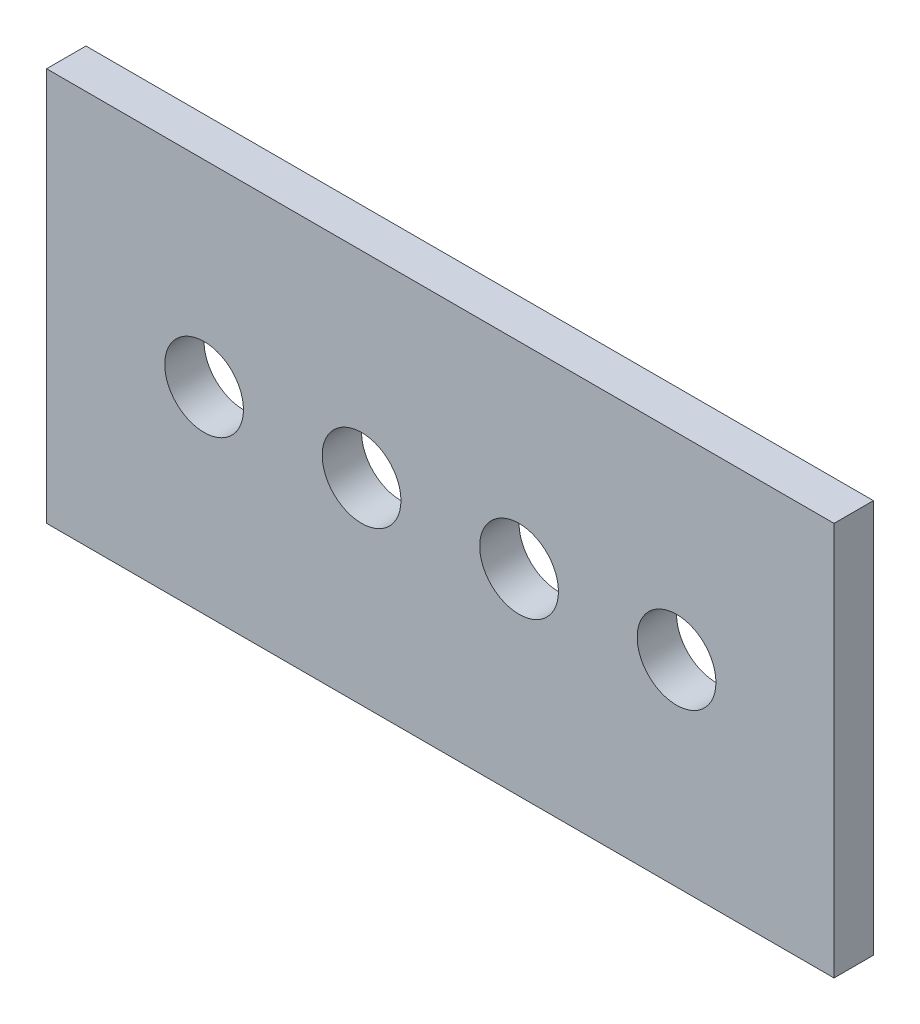
ISO-10303-21;
HEADER;
FILE_DESCRIPTION(('STEP AP214'),'2;1');
FILE_NAME('part.step','',(''),(''),'','','');
FILE_SCHEMA(('AUTOMOTIVE_DESIGN { 1 0 10303 214 1 1 1 1 }'));
ENDSEC;
DATA;
#1=APPLICATION_CONTEXT('core data for automotive mechanical design processes');
#2=APPLICATION_PROTOCOL_DEFINITION('international standard','automotive_design',2000,#1);
#3=PRODUCT_CONTEXT('',#1,'mechanical');
#4=PRODUCT('Part','Part','',(#3));
#5=PRODUCT_RELATED_PRODUCT_CATEGORY('part','',(#4));
#6=PRODUCT_DEFINITION_FORMATION('','',#4);
#7=PRODUCT_DEFINITION_CONTEXT('part definition',#1,'design');
#8=PRODUCT_DEFINITION('design','',#6,#7);
#9=PRODUCT_DEFINITION_SHAPE('','',#8);
#10=(LENGTH_UNIT() NAMED_UNIT(*) SI_UNIT(.MILLI.,.METRE.));
#11=(NAMED_UNIT(*) PLANE_ANGLE_UNIT() SI_UNIT($,.RADIAN.));
#12=(NAMED_UNIT(*) SI_UNIT($,.STERADIAN.) SOLID_ANGLE_UNIT());
#13=UNCERTAINTY_MEASURE_WITH_UNIT(LENGTH_MEASURE(1.E-05),#10,'distance_accuracy_value','');
#14=(GEOMETRIC_REPRESENTATION_CONTEXT(3) GLOBAL_UNCERTAINTY_ASSIGNED_CONTEXT((#13)) GLOBAL_UNIT_ASSIGNED_CONTEXT((#10,
#11,#12)) REPRESENTATION_CONTEXT('',''));
#15=CARTESIAN_POINT('',(0.,0.,0.));
#16=DIRECTION('',(0.,0.,1.));
#17=DIRECTION('',(1.,0.,0.));
#18=AXIS2_PLACEMENT_3D('',#15,#16,#17);
#19=CARTESIAN_POINT('',(0.,0.,5.));
#20=DIRECTION('',(0.,0.,-1.));
#21=DIRECTION('',(-1.,0.,0.));
#22=AXIS2_PLACEMENT_3D('',#19,#20,#21);
#23=PLANE('',#22);
#24=DIRECTION('',(0.,-1.,0.));
#25=VECTOR('',#24,1.);
#26=CARTESIAN_POINT('',(0.,0.,5.));
#27=LINE('',#26,#25);
#28=CARTESIAN_POINT('',(0.,50.,5.));
#29=VERTEX_POINT('',#28);
#30=CARTESIAN_POINT('',(0.,0.,5.));
#31=VERTEX_POINT('',#30);
#32=EDGE_CURVE('E89',#29,#31,#27,.T.);
#33=ORIENTED_EDGE('',*,*,#32,.T.);
#34=DIRECTION('',(1.,0.,0.));
#35=VECTOR('',#34,1.);
#36=CARTESIAN_POINT('',(0.,0.,5.));
#37=LINE('',#36,#35);
#38=CARTESIAN_POINT('',(100.,0.,5.));
#39=VERTEX_POINT('',#38);
#40=EDGE_CURVE('E84',#31,#39,#37,.T.);
#41=ORIENTED_EDGE('',*,*,#40,.T.);
#42=DIRECTION('',(0.,1.,0.));
#43=VECTOR('',#42,1.);
#44=CARTESIAN_POINT('',(100.,0.,5.));
#45=LINE('',#44,#43);
#46=CARTESIAN_POINT('',(100.,50.,5.));
#47=VERTEX_POINT('',#46);
#48=EDGE_CURVE('E87',#39,#47,#45,.T.);
#49=ORIENTED_EDGE('',*,*,#48,.T.);
#50=DIRECTION('',(-1.,0.,0.));
#51=VECTOR('',#50,1.);
#52=CARTESIAN_POINT('',(0.,50.,5.));
#53=LINE('',#52,#51);
#54=EDGE_CURVE('E54',#47,#29,#53,.T.);
#55=ORIENTED_EDGE('',*,*,#54,.T.);
#56=EDGE_LOOP('',(#33,#41,#49,#55));
#57=FACE_BOUND('',#56,.T.);
#58=CARTESIAN_POINT('',(20.,25.,5.));
#59=DIRECTION('',(0.,0.,1.));
#60=DIRECTION('',(1.,0.,0.));
#61=AXIS2_PLACEMENT_3D('',#58,#59,#60);
#62=CIRCLE('',#61,5.);
#63=CARTESIAN_POINT('',(25.,25.,5.));
#64=VERTEX_POINT('',#63);
#65=EDGE_CURVE('E104',#64,#64,#62,.T.);
#66=ORIENTED_EDGE('',*,*,#65,.F.);
#67=EDGE_LOOP('',(#66));
#68=FACE_BOUND('',#67,.T.);
#69=CARTESIAN_POINT('',(40.,25.,5.));
#70=DIRECTION('',(0.,0.,1.));
#71=DIRECTION('',(1.,0.,0.));
#72=AXIS2_PLACEMENT_3D('',#69,#70,#71);
#73=CIRCLE('',#72,5.);
#74=CARTESIAN_POINT('',(45.,25.,5.));
#75=VERTEX_POINT('',#74);
#76=EDGE_CURVE('E119',#75,#75,#73,.T.);
#77=ORIENTED_EDGE('',*,*,#76,.F.);
#78=EDGE_LOOP('',(#77));
#79=FACE_BOUND('',#78,.T.);
#80=CARTESIAN_POINT('',(60.,25.,5.));
#81=DIRECTION('',(0.,0.,1.));
#82=DIRECTION('',(1.,0.,0.));
#83=AXIS2_PLACEMENT_3D('',#80,#81,#82);
#84=CIRCLE('',#83,5.);
#85=CARTESIAN_POINT('',(65.,25.,5.));
#86=VERTEX_POINT('',#85);
#87=EDGE_CURVE('E125',#86,#86,#84,.T.);
#88=ORIENTED_EDGE('',*,*,#87,.F.);
#89=EDGE_LOOP('',(#88));
#90=FACE_BOUND('',#89,.T.);
#91=CARTESIAN_POINT('',(80.,25.,5.));
#92=DIRECTION('',(0.,0.,1.));
#93=DIRECTION('',(1.,0.,0.));
#94=AXIS2_PLACEMENT_3D('',#91,#92,#93);
#95=CIRCLE('',#94,5.);
#96=CARTESIAN_POINT('',(85.,25.,5.));
#97=VERTEX_POINT('',#96);
#98=EDGE_CURVE('E131',#97,#97,#95,.T.);
#99=ORIENTED_EDGE('',*,*,#98,.F.);
#100=EDGE_LOOP('',(#99));
#101=FACE_BOUND('',#100,.T.);
#102=ADVANCED_FACE('F37',(#57,#68,#79,#90,#101),#23,.F.);
#103=CARTESIAN_POINT('',(0.,0.,0.));
#104=DIRECTION('',(0.,0.,-1.));
#105=DIRECTION('',(-1.,0.,0.));
#106=AXIS2_PLACEMENT_3D('',#103,#104,#105);
#107=PLANE('',#106);
#108=CARTESIAN_POINT('',(60.,25.,0.));
#109=DIRECTION('',(0.,0.,1.));
#110=DIRECTION('',(1.,0.,0.));
#111=AXIS2_PLACEMENT_3D('',#108,#109,#110);
#112=CIRCLE('',#111,5.);
#113=CARTESIAN_POINT('',(65.,25.,0.));
#114=VERTEX_POINT('',#113);
#115=EDGE_CURVE('E128',#114,#114,#112,.T.);
#116=ORIENTED_EDGE('',*,*,#115,.T.);
#117=EDGE_LOOP('',(#116));
#118=FACE_BOUND('',#117,.T.);
#119=CARTESIAN_POINT('',(20.,25.,0.));
#120=DIRECTION('',(0.,0.,1.));
#121=DIRECTION('',(1.,0.,0.));
#122=AXIS2_PLACEMENT_3D('',#119,#120,#121);
#123=CIRCLE('',#122,5.);
#124=CARTESIAN_POINT('',(25.,25.,0.));
#125=VERTEX_POINT('',#124);
#126=EDGE_CURVE('E116',#125,#125,#123,.T.);
#127=ORIENTED_EDGE('',*,*,#126,.T.);
#128=EDGE_LOOP('',(#127));
#129=FACE_BOUND('',#128,.T.);
#130=DIRECTION('',(0.,-1.,0.));
#131=VECTOR('',#130,1.);
#132=CARTESIAN_POINT('',(0.,0.,0.));
#133=LINE('',#132,#131);
#134=CARTESIAN_POINT('',(0.,50.,0.));
#135=VERTEX_POINT('',#134);
#136=CARTESIAN_POINT('',(0.,0.,0.));
#137=VERTEX_POINT('',#136);
#138=EDGE_CURVE('E101',#135,#137,#133,.T.);
#139=ORIENTED_EDGE('',*,*,#138,.F.);
#140=DIRECTION('',(-1.,0.,0.));
#141=VECTOR('',#140,1.);
#142=CARTESIAN_POINT('',(0.,50.,0.));
#143=LINE('',#142,#141);
#144=CARTESIAN_POINT('',(100.,50.,0.));
#145=VERTEX_POINT('',#144);
#146=EDGE_CURVE('E77',#145,#135,#143,.T.);
#147=ORIENTED_EDGE('',*,*,#146,.F.);
#148=DIRECTION('',(0.,1.,0.));
#149=VECTOR('',#148,1.);
#150=CARTESIAN_POINT('',(100.,0.,0.));
#151=LINE('',#150,#149);
#152=CARTESIAN_POINT('',(100.,0.,0.));
#153=VERTEX_POINT('',#152);
#154=EDGE_CURVE('E71',#153,#145,#151,.T.);
#155=ORIENTED_EDGE('',*,*,#154,.F.);
#156=DIRECTION('',(1.,0.,0.));
#157=VECTOR('',#156,1.);
#158=CARTESIAN_POINT('',(0.,0.,0.));
#159=LINE('',#158,#157);
#160=EDGE_CURVE('E93',#137,#153,#159,.T.);
#161=ORIENTED_EDGE('',*,*,#160,.F.);
#162=EDGE_LOOP('',(#139,#147,#155,#161));
#163=FACE_BOUND('',#162,.T.);
#164=CARTESIAN_POINT('',(40.,25.,0.));
#165=DIRECTION('',(0.,0.,1.));
#166=DIRECTION('',(1.,0.,0.));
#167=AXIS2_PLACEMENT_3D('',#164,#165,#166);
#168=CIRCLE('',#167,5.);
#169=CARTESIAN_POINT('',(45.,25.,0.));
#170=VERTEX_POINT('',#169);
#171=EDGE_CURVE('E122',#170,#170,#168,.T.);
#172=ORIENTED_EDGE('',*,*,#171,.T.);
#173=EDGE_LOOP('',(#172));
#174=FACE_BOUND('',#173,.T.);
#175=CARTESIAN_POINT('',(80.,25.,0.));
#176=DIRECTION('',(0.,0.,1.));
#177=DIRECTION('',(1.,0.,0.));
#178=AXIS2_PLACEMENT_3D('',#175,#176,#177);
#179=CIRCLE('',#178,5.);
#180=CARTESIAN_POINT('',(85.,25.,0.));
#181=VERTEX_POINT('',#180);
#182=EDGE_CURVE('E134',#181,#181,#179,.T.);
#183=ORIENTED_EDGE('',*,*,#182,.T.);
#184=EDGE_LOOP('',(#183));
#185=FACE_BOUND('',#184,.T.);
#186=ADVANCED_FACE('F112',(#118,#129,#163,#174,#185),#107,.T.);
#187=CARTESIAN_POINT('',(0.,0.,5.));
#188=DIRECTION('',(1.,0.,0.));
#189=DIRECTION('',(0.,0.,-1.));
#190=AXIS2_PLACEMENT_3D('',#187,#188,#189);
#191=PLANE('',#190);
#192=ORIENTED_EDGE('',*,*,#138,.T.);
#193=DIRECTION('',(0.,0.,-1.));
#194=VECTOR('',#193,1.);
#195=CARTESIAN_POINT('',(0.,0.,5.));
#196=LINE('',#195,#194);
#197=EDGE_CURVE('E11',#31,#137,#196,.T.);
#198=ORIENTED_EDGE('',*,*,#197,.F.);
#199=ORIENTED_EDGE('',*,*,#32,.F.);
#200=DIRECTION('',(0.,0.,-1.));
#201=VECTOR('',#200,1.);
#202=CARTESIAN_POINT('',(0.,50.,5.));
#203=LINE('',#202,#201);
#204=EDGE_CURVE('E97',#29,#135,#203,.T.);
#205=ORIENTED_EDGE('',*,*,#204,.T.);
#206=EDGE_LOOP('',(#192,#198,#199,#205));
#207=FACE_BOUND('',#206,.T.);
#208=ADVANCED_FACE('F39',(#207),#191,.F.);
#209=CARTESIAN_POINT('',(0.,0.,5.));
#210=DIRECTION('',(0.,1.,0.));
#211=DIRECTION('',(0.,0.,1.));
#212=AXIS2_PLACEMENT_3D('',#209,#210,#211);
#213=PLANE('',#212);
#214=ORIENTED_EDGE('',*,*,#160,.T.);
#215=DIRECTION('',(0.,0.,-1.));
#216=VECTOR('',#215,1.);
#217=CARTESIAN_POINT('',(100.,0.,5.));
#218=LINE('',#217,#216);
#219=EDGE_CURVE('E46',#39,#153,#218,.T.);
#220=ORIENTED_EDGE('',*,*,#219,.F.);
#221=ORIENTED_EDGE('',*,*,#40,.F.);
#222=ORIENTED_EDGE('',*,*,#197,.T.);
#223=EDGE_LOOP('',(#214,#220,#221,#222));
#224=FACE_BOUND('',#223,.T.);
#225=ADVANCED_FACE('F92',(#224),#213,.F.);
#226=CARTESIAN_POINT('',(100.,0.,5.));
#227=DIRECTION('',(-1.,0.,0.));
#228=DIRECTION('',(0.,0.,1.));
#229=AXIS2_PLACEMENT_3D('',#226,#227,#228);
#230=PLANE('',#229);
#231=ORIENTED_EDGE('',*,*,#154,.T.);
#232=DIRECTION('',(0.,0.,-1.));
#233=VECTOR('',#232,1.);
#234=CARTESIAN_POINT('',(100.,50.,5.));
#235=LINE('',#234,#233);
#236=EDGE_CURVE('E94',#47,#145,#235,.T.);
#237=ORIENTED_EDGE('',*,*,#236,.F.);
#238=ORIENTED_EDGE('',*,*,#48,.F.);
#239=ORIENTED_EDGE('',*,*,#219,.T.);
#240=EDGE_LOOP('',(#231,#237,#238,#239));
#241=FACE_BOUND('',#240,.T.);
#242=ADVANCED_FACE('F95',(#241),#230,.F.);
#243=CARTESIAN_POINT('',(0.,50.,5.));
#244=DIRECTION('',(0.,-1.,0.));
#245=DIRECTION('',(0.,0.,-1.));
#246=AXIS2_PLACEMENT_3D('',#243,#244,#245);
#247=PLANE('',#246);
#248=ORIENTED_EDGE('',*,*,#146,.T.);
#249=ORIENTED_EDGE('',*,*,#204,.F.);
#250=ORIENTED_EDGE('',*,*,#54,.F.);
#251=ORIENTED_EDGE('',*,*,#236,.T.);
#252=EDGE_LOOP('',(#248,#249,#250,#251));
#253=FACE_BOUND('',#252,.T.);
#254=ADVANCED_FACE('F109',(#253),#247,.F.);
#255=CARTESIAN_POINT('',(20.,25.,5.));
#256=DIRECTION('',(0.,0.,-1.));
#257=DIRECTION('',(-1.,0.,0.));
#258=AXIS2_PLACEMENT_3D('',#255,#256,#257);
#259=CYLINDRICAL_SURFACE('',#258,5.);
#260=ORIENTED_EDGE('',*,*,#65,.T.);
#261=EDGE_LOOP('',(#260));
#262=FACE_BOUND('',#261,.T.);
#263=ORIENTED_EDGE('',*,*,#126,.F.);
#264=EDGE_LOOP('',(#263));
#265=FACE_BOUND('',#264,.T.);
#266=ADVANCED_FACE('F151',(#262,#265),#259,.F.);
#267=CARTESIAN_POINT('',(40.,25.,5.));
#268=DIRECTION('',(0.,0.,-1.));
#269=DIRECTION('',(-1.,0.,0.));
#270=AXIS2_PLACEMENT_3D('',#267,#268,#269);
#271=CYLINDRICAL_SURFACE('',#270,5.);
#272=ORIENTED_EDGE('',*,*,#76,.T.);
#273=EDGE_LOOP('',(#272));
#274=FACE_BOUND('',#273,.T.);
#275=ORIENTED_EDGE('',*,*,#171,.F.);
#276=EDGE_LOOP('',(#275));
#277=FACE_BOUND('',#276,.T.);
#278=ADVANCED_FACE('F197',(#274,#277),#271,.F.);
#279=CARTESIAN_POINT('',(60.,25.,5.));
#280=DIRECTION('',(0.,0.,-1.));
#281=DIRECTION('',(-1.,0.,0.));
#282=AXIS2_PLACEMENT_3D('',#279,#280,#281);
#283=CYLINDRICAL_SURFACE('',#282,5.);
#284=ORIENTED_EDGE('',*,*,#87,.T.);
#285=EDGE_LOOP('',(#284));
#286=FACE_BOUND('',#285,.T.);
#287=ORIENTED_EDGE('',*,*,#115,.F.);
#288=EDGE_LOOP('',(#287));
#289=FACE_BOUND('',#288,.T.);
#290=ADVANCED_FACE('F205',(#286,#289),#283,.F.);
#291=CARTESIAN_POINT('',(80.,25.,5.));
#292=DIRECTION('',(0.,0.,-1.));
#293=DIRECTION('',(-1.,0.,0.));
#294=AXIS2_PLACEMENT_3D('',#291,#292,#293);
#295=CYLINDRICAL_SURFACE('',#294,5.);
#296=ORIENTED_EDGE('',*,*,#98,.T.);
#297=EDGE_LOOP('',(#296));
#298=FACE_BOUND('',#297,.T.);
#299=ORIENTED_EDGE('',*,*,#182,.F.);
#300=EDGE_LOOP('',(#299));
#301=FACE_BOUND('',#300,.T.);
#302=ADVANCED_FACE('F140',(#298,#301),#295,.F.);
#303=CLOSED_SHELL('',(#102,#186,#208,#225,#242,#254,#266,#278,#290,#302));
#304=MANIFOLD_SOLID_BREP('B2',#303);
#305=ADVANCED_BREP_SHAPE_REPRESENTATION('',(#18,#304),#14);
#306=SHAPE_DEFINITION_REPRESENTATION(#9,#305);
ENDSEC;
END-ISO-10303-21;
